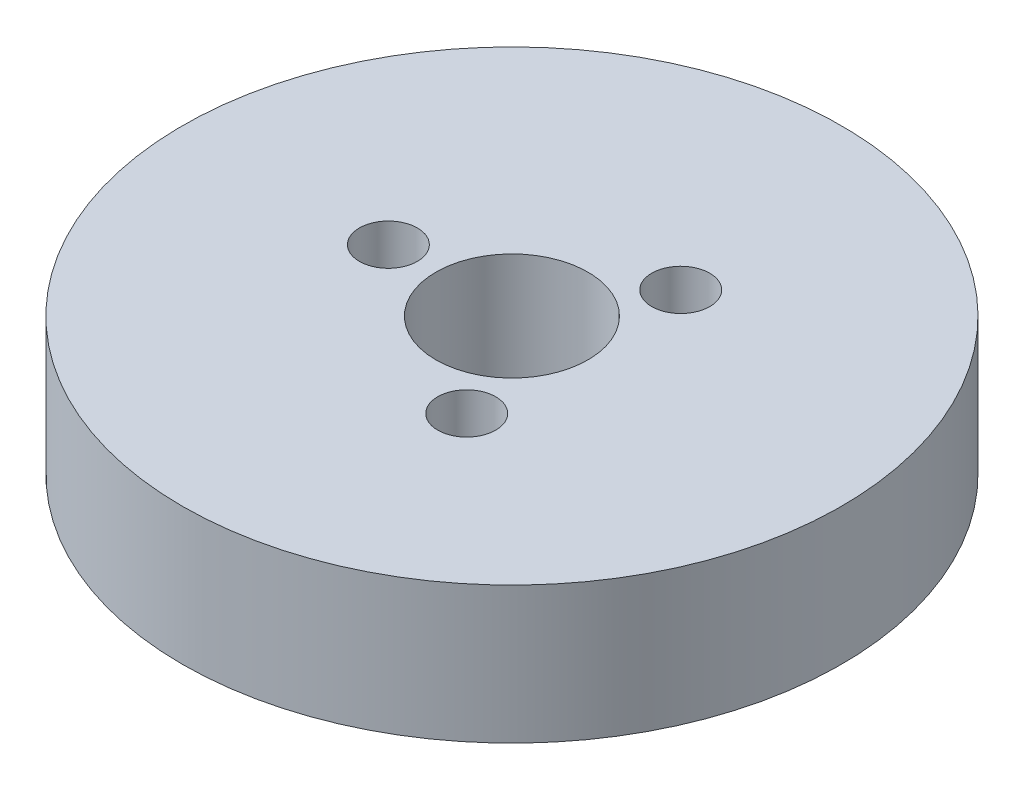
ISO-10303-21;
HEADER;
FILE_DESCRIPTION(('STEP AP214'),'2;1');
FILE_NAME('part.step','',(''),(''),'','','');
FILE_SCHEMA(('AUTOMOTIVE_DESIGN { 1 0 10303 214 1 1 1 1 }'));
ENDSEC;
DATA;
#1=APPLICATION_CONTEXT('core data for automotive mechanical design processes');
#2=APPLICATION_PROTOCOL_DEFINITION('international standard','automotive_design',2000,#1);
#3=PRODUCT_CONTEXT('',#1,'mechanical');
#4=PRODUCT('Part','Part','',(#3));
#5=PRODUCT_RELATED_PRODUCT_CATEGORY('part','',(#4));
#6=PRODUCT_DEFINITION_FORMATION('','',#4);
#7=PRODUCT_DEFINITION_CONTEXT('part definition',#1,'design');
#8=PRODUCT_DEFINITION('design','',#6,#7);
#9=PRODUCT_DEFINITION_SHAPE('','',#8);
#10=(LENGTH_UNIT() NAMED_UNIT(*) SI_UNIT(.MILLI.,.METRE.));
#11=(NAMED_UNIT(*) PLANE_ANGLE_UNIT() SI_UNIT($,.RADIAN.));
#12=(NAMED_UNIT(*) SI_UNIT($,.STERADIAN.) SOLID_ANGLE_UNIT());
#13=UNCERTAINTY_MEASURE_WITH_UNIT(LENGTH_MEASURE(1.E-05),#10,'distance_accuracy_value','');
#14=(GEOMETRIC_REPRESENTATION_CONTEXT(3) GLOBAL_UNCERTAINTY_ASSIGNED_CONTEXT((#13)) GLOBAL_UNIT_ASSIGNED_CONTEXT((#10,
#11,#12)) REPRESENTATION_CONTEXT('',''));
#15=CARTESIAN_POINT('',(0.,0.,0.));
#16=DIRECTION('',(0.,0.,1.));
#17=DIRECTION('',(1.,0.,0.));
#18=AXIS2_PLACEMENT_3D('',#15,#16,#17);
#19=CARTESIAN_POINT('',(0.,27.,0.));
#20=DIRECTION('',(0.,-1.,0.));
#21=DIRECTION('',(0.,0.,-1.));
#22=AXIS2_PLACEMENT_3D('',#19,#20,#21);
#23=CYLINDRICAL_SURFACE('',#22,65.);
#24=CARTESIAN_POINT('',(0.,27.,0.));
#25=DIRECTION('',(0.,1.,0.));
#26=DIRECTION('',(0.,0.,1.));
#27=AXIS2_PLACEMENT_3D('',#24,#25,#26);
#28=CIRCLE('',#27,65.);
#29=CARTESIAN_POINT('',(0.,27.,65.));
#30=VERTEX_POINT('',#29);
#31=EDGE_CURVE('E10',#30,#30,#28,.T.);
#32=ORIENTED_EDGE('',*,*,#31,.F.);
#33=EDGE_LOOP('',(#32));
#34=FACE_BOUND('',#33,.T.);
#35=CARTESIAN_POINT('',(0.,0.,0.));
#36=DIRECTION('',(0.,1.,0.));
#37=DIRECTION('',(0.,0.,1.));
#38=AXIS2_PLACEMENT_3D('',#35,#36,#37);
#39=CIRCLE('',#38,65.);
#40=CARTESIAN_POINT('',(0.,0.,65.));
#41=VERTEX_POINT('',#40);
#42=EDGE_CURVE('E37',#41,#41,#39,.T.);
#43=ORIENTED_EDGE('',*,*,#42,.T.);
#44=EDGE_LOOP('',(#43));
#45=FACE_BOUND('',#44,.T.);
#46=ADVANCED_FACE('F40',(#34,#45),#23,.T.);
#47=CARTESIAN_POINT('',(0.,27.,0.));
#48=DIRECTION('',(0.,1.,0.));
#49=DIRECTION('',(0.,0.,1.));
#50=AXIS2_PLACEMENT_3D('',#47,#48,#49);
#51=PLANE('',#50);
#52=CARTESIAN_POINT('',(12.184809828237,27.,21.1047097030708));
#53=DIRECTION('',(0.,1.,0.));
#54=DIRECTION('',(0.866025403784436,0.,-0.500000000000004));
#55=AXIS2_PLACEMENT_3D('',#52,#53,#54);
#56=CIRCLE('',#55,5.7180251321907);
#57=CARTESIAN_POINT('',(17.136764852192,27.,18.2456971369754));
#58=VERTEX_POINT('',#57);
#59=EDGE_CURVE('E70',#58,#58,#56,.T.);
#60=ORIENTED_EDGE('',*,*,#59,.F.);
#61=EDGE_LOOP('',(#60));
#62=FACE_BOUND('',#61,.T.);
#63=CARTESIAN_POINT('',(12.1848098282367,27.,-21.104709703071));
#64=DIRECTION('',(0.,1.,0.));
#65=DIRECTION('',(-0.866025403784443,0.,-0.499999999999992));
#66=AXIS2_PLACEMENT_3D('',#63,#64,#65);
#67=CIRCLE('',#66,5.7180251321907);
#68=CARTESIAN_POINT('',(7.23285480428161,27.,-23.9637222691663));
#69=VERTEX_POINT('',#68);
#70=EDGE_CURVE('E61',#69,#69,#67,.T.);
#71=ORIENTED_EDGE('',*,*,#70,.F.);
#72=EDGE_LOOP('',(#71));
#73=FACE_BOUND('',#72,.T.);
#74=CARTESIAN_POINT('',(-24.3696196564737,27.,0.));
#75=DIRECTION('',(0.,1.,0.));
#76=DIRECTION('',(0.,0.,1.));
#77=AXIS2_PLACEMENT_3D('',#74,#75,#76);
#78=CIRCLE('',#77,5.7180251321907);
#79=CARTESIAN_POINT('',(-24.3696196564737,27.,5.7180251321907));
#80=VERTEX_POINT('',#79);
#81=EDGE_CURVE('E54',#80,#80,#78,.T.);
#82=ORIENTED_EDGE('',*,*,#81,.F.);
#83=EDGE_LOOP('',(#82));
#84=FACE_BOUND('',#83,.T.);
#85=CARTESIAN_POINT('',(0.,27.,0.));
#86=DIRECTION('',(0.,1.,0.));
#87=DIRECTION('',(0.,0.,1.));
#88=AXIS2_PLACEMENT_3D('',#85,#86,#87);
#89=CIRCLE('',#88,15.);
#90=CARTESIAN_POINT('',(0.,27.,15.));
#91=VERTEX_POINT('',#90);
#92=EDGE_CURVE('E50',#91,#91,#89,.T.);
#93=ORIENTED_EDGE('',*,*,#92,.F.);
#94=EDGE_LOOP('',(#93));
#95=FACE_BOUND('',#94,.T.);
#96=ORIENTED_EDGE('',*,*,#31,.T.);
#97=EDGE_LOOP('',(#96));
#98=FACE_BOUND('',#97,.T.);
#99=ADVANCED_FACE('F85',(#62,#73,#84,#95,#98),#51,.T.);
#100=CARTESIAN_POINT('',(0.,0.,0.));
#101=DIRECTION('',(0.,1.,0.));
#102=DIRECTION('',(0.,0.,1.));
#103=AXIS2_PLACEMENT_3D('',#100,#101,#102);
#104=PLANE('',#103);
#105=CARTESIAN_POINT('',(0.,0.,0.));
#106=DIRECTION('',(0.,1.,0.));
#107=DIRECTION('',(0.,0.,1.));
#108=AXIS2_PLACEMENT_3D('',#105,#106,#107);
#109=CIRCLE('',#108,15.);
#110=CARTESIAN_POINT('',(0.,0.,15.));
#111=VERTEX_POINT('',#110);
#112=EDGE_CURVE('E47',#111,#111,#109,.T.);
#113=ORIENTED_EDGE('',*,*,#112,.T.);
#114=EDGE_LOOP('',(#113));
#115=FACE_BOUND('',#114,.T.);
#116=ORIENTED_EDGE('',*,*,#42,.F.);
#117=EDGE_LOOP('',(#116));
#118=FACE_BOUND('',#117,.T.);
#119=ADVANCED_FACE('F84',(#115,#118),#104,.F.);
#120=CARTESIAN_POINT('',(0.,27.,0.));
#121=DIRECTION('',(0.,-1.,0.));
#122=DIRECTION('',(0.,0.,-1.));
#123=AXIS2_PLACEMENT_3D('',#120,#121,#122);
#124=CYLINDRICAL_SURFACE('',#123,15.);
#125=ORIENTED_EDGE('',*,*,#92,.T.);
#126=EDGE_LOOP('',(#125));
#127=FACE_BOUND('',#126,.T.);
#128=ORIENTED_EDGE('',*,*,#112,.F.);
#129=EDGE_LOOP('',(#128));
#130=FACE_BOUND('',#129,.T.);
#131=ADVANCED_FACE('F91',(#127,#130),#124,.F.);
#132=CARTESIAN_POINT('',(-24.3696196564737,4.26220179680413,0.));
#133=DIRECTION('',(0.,1.,0.));
#134=DIRECTION('',(0.,0.,1.));
#135=AXIS2_PLACEMENT_3D('',#132,#133,#134);
#136=CYLINDRICAL_SURFACE('',#135,5.7180251321907);
#137=CARTESIAN_POINT('',(-24.3696196564737,4.26220179680413,0.));
#138=DIRECTION('',(0.,1.,0.));
#139=DIRECTION('',(0.,0.,1.));
#140=AXIS2_PLACEMENT_3D('',#137,#138,#139);
#141=CIRCLE('',#140,5.7180251321907);
#142=CARTESIAN_POINT('',(-24.3696196564737,4.26220179680413,5.7180251321907));
#143=VERTEX_POINT('',#142);
#144=EDGE_CURVE('E55',#143,#143,#141,.T.);
#145=ORIENTED_EDGE('',*,*,#144,.F.);
#146=EDGE_LOOP('',(#145));
#147=FACE_BOUND('',#146,.T.);
#148=ORIENTED_EDGE('',*,*,#81,.T.);
#149=EDGE_LOOP('',(#148));
#150=FACE_BOUND('',#149,.T.);
#151=ADVANCED_FACE('F96',(#147,#150),#136,.F.);
#152=CARTESIAN_POINT('',(-24.3696196564737,4.26220179680413,0.));
#153=DIRECTION('',(0.,1.,0.));
#154=DIRECTION('',(0.,0.,1.));
#155=AXIS2_PLACEMENT_3D('',#152,#153,#154);
#156=PLANE('',#155);
#157=ORIENTED_EDGE('',*,*,#144,.T.);
#158=EDGE_LOOP('',(#157));
#159=FACE_BOUND('',#158,.T.);
#160=ADVANCED_FACE('F127',(#159),#156,.T.);
#161=CARTESIAN_POINT('',(12.1848098282367,4.26220179680413,-21.104709703071));
#162=DIRECTION('',(0.,1.,0.));
#163=DIRECTION('',(0.,0.,1.));
#164=AXIS2_PLACEMENT_3D('',#161,#162,#163);
#165=CYLINDRICAL_SURFACE('',#164,5.7180251321907);
#166=CARTESIAN_POINT('',(12.1848098282367,4.26220179680413,-21.104709703071));
#167=DIRECTION('',(0.,1.,0.));
#168=DIRECTION('',(-0.866025403784443,0.,-0.499999999999992));
#169=AXIS2_PLACEMENT_3D('',#166,#167,#168);
#170=CIRCLE('',#169,5.7180251321907);
#171=CARTESIAN_POINT('',(7.23285480428161,4.26220179680413,-23.9637222691663));
#172=VERTEX_POINT('',#171);
#173=EDGE_CURVE('E63',#172,#172,#170,.T.);
#174=ORIENTED_EDGE('',*,*,#173,.F.);
#175=EDGE_LOOP('',(#174));
#176=FACE_BOUND('',#175,.T.);
#177=ORIENTED_EDGE('',*,*,#70,.T.);
#178=EDGE_LOOP('',(#177));
#179=FACE_BOUND('',#178,.T.);
#180=ADVANCED_FACE('F133',(#176,#179),#165,.F.);
#181=CARTESIAN_POINT('',(12.1848098282367,4.26220179680413,-21.104709703071));
#182=DIRECTION('',(0.,1.,0.));
#183=DIRECTION('',(-0.866025403784443,0.,-0.499999999999992));
#184=AXIS2_PLACEMENT_3D('',#181,#182,#183);
#185=PLANE('',#184);
#186=ORIENTED_EDGE('',*,*,#173,.T.);
#187=EDGE_LOOP('',(#186));
#188=FACE_BOUND('',#187,.T.);
#189=ADVANCED_FACE('F77',(#188),#185,.T.);
#190=CARTESIAN_POINT('',(12.184809828237,4.26220179680413,21.1047097030708));
#191=DIRECTION('',(0.,1.,0.));
#192=DIRECTION('',(0.,0.,1.));
#193=AXIS2_PLACEMENT_3D('',#190,#191,#192);
#194=CYLINDRICAL_SURFACE('',#193,5.7180251321907);
#195=CARTESIAN_POINT('',(12.184809828237,4.26220179680413,21.1047097030708));
#196=DIRECTION('',(0.,1.,0.));
#197=DIRECTION('',(0.866025403784436,0.,-0.500000000000004));
#198=AXIS2_PLACEMENT_3D('',#195,#196,#197);
#199=CIRCLE('',#198,5.7180251321907);
#200=CARTESIAN_POINT('',(17.136764852192,4.26220179680413,18.2456971369754));
#201=VERTEX_POINT('',#200);
#202=EDGE_CURVE('E59',#201,#201,#199,.T.);
#203=ORIENTED_EDGE('',*,*,#202,.F.);
#204=EDGE_LOOP('',(#203));
#205=FACE_BOUND('',#204,.T.);
#206=ORIENTED_EDGE('',*,*,#59,.T.);
#207=EDGE_LOOP('',(#206));
#208=FACE_BOUND('',#207,.T.);
#209=ADVANCED_FACE('F73',(#205,#208),#194,.F.);
#210=CARTESIAN_POINT('',(12.184809828237,4.26220179680413,21.1047097030708));
#211=DIRECTION('',(0.,1.,0.));
#212=DIRECTION('',(0.866025403784436,0.,-0.500000000000004));
#213=AXIS2_PLACEMENT_3D('',#210,#211,#212);
#214=PLANE('',#213);
#215=ORIENTED_EDGE('',*,*,#202,.T.);
#216=EDGE_LOOP('',(#215));
#217=FACE_BOUND('',#216,.T.);
#218=ADVANCED_FACE('F71',(#217),#214,.T.);
#219=CLOSED_SHELL('',(#46,#99,#119,#131,#151,#160,#180,#189,#209,#218));
#220=MANIFOLD_SOLID_BREP('B2',#219);
#221=ADVANCED_BREP_SHAPE_REPRESENTATION('',(#18,#220),#14);
#222=SHAPE_DEFINITION_REPRESENTATION(#9,#221);
ENDSEC;
END-ISO-10303-21;
